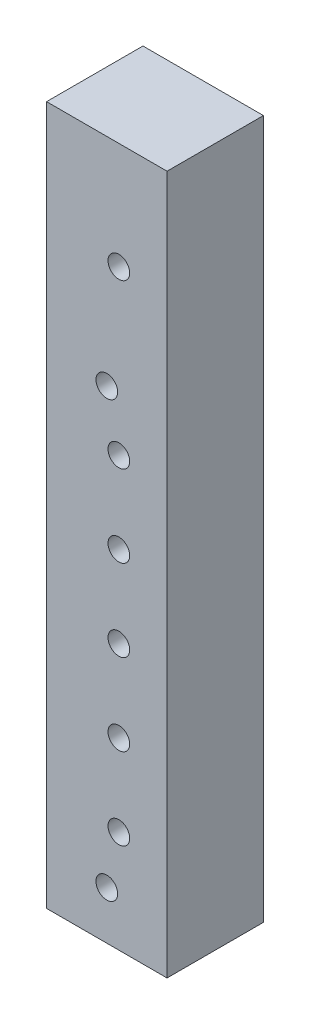
ISO-10303-21;
HEADER;
FILE_DESCRIPTION(('STEP AP214'),'2;1');
FILE_NAME('part.step','',(''),(''),'','','');
FILE_SCHEMA(('AUTOMOTIVE_DESIGN { 1 0 10303 214 1 1 1 1 }'));
ENDSEC;
DATA;
#1=APPLICATION_CONTEXT('core data for automotive mechanical design processes');
#2=APPLICATION_PROTOCOL_DEFINITION('international standard','automotive_design',2000,#1);
#3=PRODUCT_CONTEXT('',#1,'mechanical');
#4=PRODUCT('Part','Part','',(#3));
#5=PRODUCT_RELATED_PRODUCT_CATEGORY('part','',(#4));
#6=PRODUCT_DEFINITION_FORMATION('','',#4);
#7=PRODUCT_DEFINITION_CONTEXT('part definition',#1,'design');
#8=PRODUCT_DEFINITION('design','',#6,#7);
#9=PRODUCT_DEFINITION_SHAPE('','',#8);
#10=(LENGTH_UNIT() NAMED_UNIT(*) SI_UNIT(.MILLI.,.METRE.));
#11=(NAMED_UNIT(*) PLANE_ANGLE_UNIT() SI_UNIT($,.RADIAN.));
#12=(NAMED_UNIT(*) SI_UNIT($,.STERADIAN.) SOLID_ANGLE_UNIT());
#13=UNCERTAINTY_MEASURE_WITH_UNIT(LENGTH_MEASURE(1.E-05),#10,'distance_accuracy_value','');
#14=(GEOMETRIC_REPRESENTATION_CONTEXT(3) GLOBAL_UNCERTAINTY_ASSIGNED_CONTEXT((#13)) GLOBAL_UNIT_ASSIGNED_CONTEXT((#10,
#11,#12)) REPRESENTATION_CONTEXT('',''));
#15=CARTESIAN_POINT('',(0.,0.,0.));
#16=DIRECTION('',(0.,0.,1.));
#17=DIRECTION('',(1.,0.,0.));
#18=AXIS2_PLACEMENT_3D('',#15,#16,#17);
#19=CARTESIAN_POINT('',(7.5,87.,6.));
#20=DIRECTION('',(1.,0.,0.));
#21=DIRECTION('',(0.,0.,-1.));
#22=AXIS2_PLACEMENT_3D('',#19,#20,#21);
#23=PLANE('',#22);
#24=DIRECTION('',(0.,-1.,0.));
#25=VECTOR('',#24,1.);
#26=CARTESIAN_POINT('',(7.5,87.,-6.));
#27=LINE('',#26,#25);
#28=CARTESIAN_POINT('',(7.5,87.,-6.));
#29=VERTEX_POINT('',#28);
#30=CARTESIAN_POINT('',(7.5,0.,-6.));
#31=VERTEX_POINT('',#30);
#32=EDGE_CURVE('E102',#29,#31,#27,.T.);
#33=ORIENTED_EDGE('',*,*,#32,.F.);
#34=DIRECTION('',(0.,0.,-1.));
#35=VECTOR('',#34,1.);
#36=CARTESIAN_POINT('',(7.5,87.,6.));
#37=LINE('',#36,#35);
#38=CARTESIAN_POINT('',(7.5,87.,6.));
#39=VERTEX_POINT('',#38);
#40=EDGE_CURVE('E11',#39,#29,#37,.T.);
#41=ORIENTED_EDGE('',*,*,#40,.F.);
#42=DIRECTION('',(0.,-1.,0.));
#43=VECTOR('',#42,1.);
#44=CARTESIAN_POINT('',(7.5,87.,6.));
#45=LINE('',#44,#43);
#46=CARTESIAN_POINT('',(7.5,0.,6.));
#47=VERTEX_POINT('',#46);
#48=EDGE_CURVE('E95',#39,#47,#45,.T.);
#49=ORIENTED_EDGE('',*,*,#48,.T.);
#50=DIRECTION('',(0.,0.,-1.));
#51=VECTOR('',#50,1.);
#52=CARTESIAN_POINT('',(7.5,0.,6.));
#53=LINE('',#52,#51);
#54=EDGE_CURVE('E40',#47,#31,#53,.T.);
#55=ORIENTED_EDGE('',*,*,#54,.T.);
#56=EDGE_LOOP('',(#33,#41,#49,#55));
#57=FACE_BOUND('',#56,.T.);
#58=ADVANCED_FACE('F37',(#57),#23,.T.);
#59=CARTESIAN_POINT('',(-7.5,87.,6.));
#60=DIRECTION('',(0.,1.,0.));
#61=DIRECTION('',(0.,0.,1.));
#62=AXIS2_PLACEMENT_3D('',#59,#60,#61);
#63=PLANE('',#62);
#64=DIRECTION('',(1.,0.,0.));
#65=VECTOR('',#64,1.);
#66=CARTESIAN_POINT('',(-7.5,87.,-6.));
#67=LINE('',#66,#65);
#68=CARTESIAN_POINT('',(-7.5,87.,-6.));
#69=VERTEX_POINT('',#68);
#70=EDGE_CURVE('E97',#69,#29,#67,.T.);
#71=ORIENTED_EDGE('',*,*,#70,.F.);
#72=DIRECTION('',(0.,0.,-1.));
#73=VECTOR('',#72,1.);
#74=CARTESIAN_POINT('',(-7.5,87.,6.));
#75=LINE('',#74,#73);
#76=CARTESIAN_POINT('',(-7.5,87.,6.));
#77=VERTEX_POINT('',#76);
#78=EDGE_CURVE('E46',#77,#69,#75,.T.);
#79=ORIENTED_EDGE('',*,*,#78,.F.);
#80=DIRECTION('',(1.,0.,0.));
#81=VECTOR('',#80,1.);
#82=CARTESIAN_POINT('',(-7.5,87.,6.));
#83=LINE('',#82,#81);
#84=EDGE_CURVE('E92',#77,#39,#83,.T.);
#85=ORIENTED_EDGE('',*,*,#84,.T.);
#86=ORIENTED_EDGE('',*,*,#40,.T.);
#87=EDGE_LOOP('',(#71,#79,#85,#86));
#88=FACE_BOUND('',#87,.T.);
#89=ADVANCED_FACE('F113',(#88),#63,.T.);
#90=CARTESIAN_POINT('',(-7.5,0.,6.));
#91=DIRECTION('',(-1.,0.,0.));
#92=DIRECTION('',(0.,0.,1.));
#93=AXIS2_PLACEMENT_3D('',#90,#91,#92);
#94=PLANE('',#93);
#95=DIRECTION('',(0.,1.,0.));
#96=VECTOR('',#95,1.);
#97=CARTESIAN_POINT('',(-7.5,0.,-6.));
#98=LINE('',#97,#96);
#99=CARTESIAN_POINT('',(-7.5,0.,-6.));
#100=VERTEX_POINT('',#99);
#101=EDGE_CURVE('E87',#100,#69,#98,.T.);
#102=ORIENTED_EDGE('',*,*,#101,.F.);
#103=DIRECTION('',(0.,0.,-1.));
#104=VECTOR('',#103,1.);
#105=CARTESIAN_POINT('',(-7.5,0.,6.));
#106=LINE('',#105,#104);
#107=CARTESIAN_POINT('',(-7.5,0.,6.));
#108=VERTEX_POINT('',#107);
#109=EDGE_CURVE('E82',#108,#100,#106,.T.);
#110=ORIENTED_EDGE('',*,*,#109,.F.);
#111=DIRECTION('',(0.,1.,0.));
#112=VECTOR('',#111,1.);
#113=CARTESIAN_POINT('',(-7.5,0.,6.));
#114=LINE('',#113,#112);
#115=EDGE_CURVE('E85',#108,#77,#114,.T.);
#116=ORIENTED_EDGE('',*,*,#115,.T.);
#117=ORIENTED_EDGE('',*,*,#78,.T.);
#118=EDGE_LOOP('',(#102,#110,#116,#117));
#119=FACE_BOUND('',#118,.T.);
#120=ADVANCED_FACE('F84',(#119),#94,.T.);
#121=CARTESIAN_POINT('',(7.5,0.,6.));
#122=DIRECTION('',(0.,-1.,0.));
#123=DIRECTION('',(0.,0.,-1.));
#124=AXIS2_PLACEMENT_3D('',#121,#122,#123);
#125=PLANE('',#124);
#126=DIRECTION('',(-1.,0.,0.));
#127=VECTOR('',#126,1.);
#128=CARTESIAN_POINT('',(7.5,0.,-6.));
#129=LINE('',#128,#127);
#130=EDGE_CURVE('E105',#31,#100,#129,.T.);
#131=ORIENTED_EDGE('',*,*,#130,.F.);
#132=ORIENTED_EDGE('',*,*,#54,.F.);
#133=DIRECTION('',(-1.,0.,0.));
#134=VECTOR('',#133,1.);
#135=CARTESIAN_POINT('',(7.5,0.,6.));
#136=LINE('',#135,#134);
#137=EDGE_CURVE('E91',#47,#108,#136,.T.);
#138=ORIENTED_EDGE('',*,*,#137,.T.);
#139=ORIENTED_EDGE('',*,*,#109,.T.);
#140=EDGE_LOOP('',(#131,#132,#138,#139));
#141=FACE_BOUND('',#140,.T.);
#142=ADVANCED_FACE('F94',(#141),#125,.T.);
#143=CARTESIAN_POINT('',(0.,0.,6.));
#144=DIRECTION('',(0.,0.,-1.));
#145=DIRECTION('',(-1.,0.,0.));
#146=AXIS2_PLACEMENT_3D('',#143,#144,#145);
#147=PLANE('',#146);
#148=CARTESIAN_POINT('',(1.5000000000002,73.69,6.));
#149=DIRECTION('',(0.,0.,-1.));
#150=DIRECTION('',(1.,0.,0.));
#151=AXIS2_PLACEMENT_3D('',#148,#149,#150);
#152=CIRCLE('',#151,1.35);
#153=CARTESIAN_POINT('',(2.8500000000002,73.69,6.));
#154=VERTEX_POINT('',#153);
#155=EDGE_CURVE('E170',#154,#154,#152,.T.);
#156=ORIENTED_EDGE('',*,*,#155,.T.);
#157=EDGE_LOOP('',(#156));
#158=FACE_BOUND('',#157,.T.);
#159=CARTESIAN_POINT('',(1.50000000000014,53.37,6.));
#160=DIRECTION('',(0.,0.,-1.));
#161=DIRECTION('',(1.,0.,0.));
#162=AXIS2_PLACEMENT_3D('',#159,#160,#161);
#163=CIRCLE('',#162,1.35);
#164=CARTESIAN_POINT('',(2.85000000000014,53.37,6.));
#165=VERTEX_POINT('',#164);
#166=EDGE_CURVE('E178',#165,#165,#163,.T.);
#167=ORIENTED_EDGE('',*,*,#166,.T.);
#168=EDGE_LOOP('',(#167));
#169=FACE_BOUND('',#168,.T.);
#170=CARTESIAN_POINT('',(1.50000000000007,33.05,6.));
#171=DIRECTION('',(0.,0.,-1.));
#172=DIRECTION('',(1.,0.,0.));
#173=AXIS2_PLACEMENT_3D('',#170,#171,#172);
#174=CIRCLE('',#173,1.35);
#175=CARTESIAN_POINT('',(2.85000000000007,33.05,6.));
#176=VERTEX_POINT('',#175);
#177=EDGE_CURVE('E184',#176,#176,#174,.T.);
#178=ORIENTED_EDGE('',*,*,#177,.T.);
#179=EDGE_LOOP('',(#178));
#180=FACE_BOUND('',#179,.T.);
#181=CARTESIAN_POINT('',(1.5,12.73,6.));
#182=DIRECTION('',(0.,0.,-1.));
#183=DIRECTION('',(1.,0.,0.));
#184=AXIS2_PLACEMENT_3D('',#181,#182,#183);
#185=CIRCLE('',#184,1.35);
#186=CARTESIAN_POINT('',(2.85,12.73,6.));
#187=VERTEX_POINT('',#186);
#188=EDGE_CURVE('E190',#187,#187,#185,.T.);
#189=ORIENTED_EDGE('',*,*,#188,.T.);
#190=EDGE_LOOP('',(#189));
#191=FACE_BOUND('',#190,.T.);
#192=CARTESIAN_POINT('',(0.,6.,6.));
#193=DIRECTION('',(0.,0.,-1.));
#194=DIRECTION('',(1.,0.,0.));
#195=AXIS2_PLACEMENT_3D('',#192,#193,#194);
#196=CIRCLE('',#195,1.35);
#197=CARTESIAN_POINT('',(1.35,6.,6.));
#198=VERTEX_POINT('',#197);
#199=EDGE_CURVE('E196',#198,#198,#196,.T.);
#200=ORIENTED_EDGE('',*,*,#199,.T.);
#201=EDGE_LOOP('',(#200));
#202=FACE_BOUND('',#201,.T.);
#203=CARTESIAN_POINT('',(0.,60.1,6.));
#204=DIRECTION('',(0.,0.,-1.));
#205=DIRECTION('',(1.,0.,0.));
#206=AXIS2_PLACEMENT_3D('',#203,#204,#205);
#207=CIRCLE('',#206,1.35);
#208=CARTESIAN_POINT('',(1.35,60.1,6.));
#209=VERTEX_POINT('',#208);
#210=EDGE_CURVE('E202',#209,#209,#207,.T.);
#211=ORIENTED_EDGE('',*,*,#210,.T.);
#212=EDGE_LOOP('',(#211));
#213=FACE_BOUND('',#212,.T.);
#214=CARTESIAN_POINT('',(1.5000000000001,43.21,6.));
#215=DIRECTION('',(0.,0.,-1.));
#216=DIRECTION('',(1.,0.,0.));
#217=AXIS2_PLACEMENT_3D('',#214,#215,#216);
#218=CIRCLE('',#217,1.34999999999999);
#219=CARTESIAN_POINT('',(2.85000000000009,43.21,6.));
#220=VERTEX_POINT('',#219);
#221=EDGE_CURVE('E208',#220,#220,#218,.T.);
#222=ORIENTED_EDGE('',*,*,#221,.T.);
#223=EDGE_LOOP('',(#222));
#224=FACE_BOUND('',#223,.T.);
#225=CARTESIAN_POINT('',(1.50000000000003,22.89,6.));
#226=DIRECTION('',(0.,0.,-1.));
#227=DIRECTION('',(1.,0.,0.));
#228=AXIS2_PLACEMENT_3D('',#225,#226,#227);
#229=CIRCLE('',#228,1.34999999999999);
#230=CARTESIAN_POINT('',(2.85000000000002,22.89,6.));
#231=VERTEX_POINT('',#230);
#232=EDGE_CURVE('E106',#231,#231,#229,.T.);
#233=ORIENTED_EDGE('',*,*,#232,.T.);
#234=EDGE_LOOP('',(#233));
#235=FACE_BOUND('',#234,.T.);
#236=ORIENTED_EDGE('',*,*,#48,.F.);
#237=ORIENTED_EDGE('',*,*,#84,.F.);
#238=ORIENTED_EDGE('',*,*,#115,.F.);
#239=ORIENTED_EDGE('',*,*,#137,.F.);
#240=EDGE_LOOP('',(#236,#237,#238,#239));
#241=FACE_BOUND('',#240,.T.);
#242=ADVANCED_FACE('F90',(#158,#169,#180,#191,#202,#213,#224,#235,#241),#147,.F.);
#243=CARTESIAN_POINT('',(0.,0.,-6.));
#244=DIRECTION('',(0.,0.,-1.));
#245=DIRECTION('',(-1.,0.,0.));
#246=AXIS2_PLACEMENT_3D('',#243,#244,#245);
#247=PLANE('',#246);
#248=CARTESIAN_POINT('',(1.5000000000002,73.69,-6.));
#249=DIRECTION('',(0.,0.,-1.));
#250=DIRECTION('',(1.,0.,0.));
#251=AXIS2_PLACEMENT_3D('',#248,#249,#250);
#252=CIRCLE('',#251,1.35);
#253=CARTESIAN_POINT('',(2.8500000000002,73.69,-6.));
#254=VERTEX_POINT('',#253);
#255=EDGE_CURVE('E173',#254,#254,#252,.T.);
#256=ORIENTED_EDGE('',*,*,#255,.F.);
#257=EDGE_LOOP('',(#256));
#258=FACE_BOUND('',#257,.T.);
#259=CARTESIAN_POINT('',(1.50000000000014,53.37,-6.));
#260=DIRECTION('',(0.,0.,-1.));
#261=DIRECTION('',(1.,0.,0.));
#262=AXIS2_PLACEMENT_3D('',#259,#260,#261);
#263=CIRCLE('',#262,1.35);
#264=CARTESIAN_POINT('',(2.85000000000014,53.37,-6.));
#265=VERTEX_POINT('',#264);
#266=EDGE_CURVE('E175',#265,#265,#263,.T.);
#267=ORIENTED_EDGE('',*,*,#266,.F.);
#268=EDGE_LOOP('',(#267));
#269=FACE_BOUND('',#268,.T.);
#270=CARTESIAN_POINT('',(1.50000000000007,33.05,-6.));
#271=DIRECTION('',(0.,0.,-1.));
#272=DIRECTION('',(1.,0.,0.));
#273=AXIS2_PLACEMENT_3D('',#270,#271,#272);
#274=CIRCLE('',#273,1.35);
#275=CARTESIAN_POINT('',(2.85000000000007,33.05,-6.));
#276=VERTEX_POINT('',#275);
#277=EDGE_CURVE('E181',#276,#276,#274,.T.);
#278=ORIENTED_EDGE('',*,*,#277,.F.);
#279=EDGE_LOOP('',(#278));
#280=FACE_BOUND('',#279,.T.);
#281=CARTESIAN_POINT('',(1.5,12.73,-6.));
#282=DIRECTION('',(0.,0.,-1.));
#283=DIRECTION('',(1.,0.,0.));
#284=AXIS2_PLACEMENT_3D('',#281,#282,#283);
#285=CIRCLE('',#284,1.35);
#286=CARTESIAN_POINT('',(2.85,12.73,-6.));
#287=VERTEX_POINT('',#286);
#288=EDGE_CURVE('E187',#287,#287,#285,.T.);
#289=ORIENTED_EDGE('',*,*,#288,.F.);
#290=EDGE_LOOP('',(#289));
#291=FACE_BOUND('',#290,.T.);
#292=CARTESIAN_POINT('',(0.,6.,-6.));
#293=DIRECTION('',(0.,0.,-1.));
#294=DIRECTION('',(1.,0.,0.));
#295=AXIS2_PLACEMENT_3D('',#292,#293,#294);
#296=CIRCLE('',#295,1.35);
#297=CARTESIAN_POINT('',(1.35,6.,-6.));
#298=VERTEX_POINT('',#297);
#299=EDGE_CURVE('E193',#298,#298,#296,.T.);
#300=ORIENTED_EDGE('',*,*,#299,.F.);
#301=EDGE_LOOP('',(#300));
#302=FACE_BOUND('',#301,.T.);
#303=CARTESIAN_POINT('',(0.,60.1,-6.));
#304=DIRECTION('',(0.,0.,-1.));
#305=DIRECTION('',(1.,0.,0.));
#306=AXIS2_PLACEMENT_3D('',#303,#304,#305);
#307=CIRCLE('',#306,1.35);
#308=CARTESIAN_POINT('',(1.35,60.1,-6.));
#309=VERTEX_POINT('',#308);
#310=EDGE_CURVE('E199',#309,#309,#307,.T.);
#311=ORIENTED_EDGE('',*,*,#310,.F.);
#312=EDGE_LOOP('',(#311));
#313=FACE_BOUND('',#312,.T.);
#314=CARTESIAN_POINT('',(1.5000000000001,43.21,-6.));
#315=DIRECTION('',(0.,0.,-1.));
#316=DIRECTION('',(1.,0.,0.));
#317=AXIS2_PLACEMENT_3D('',#314,#315,#316);
#318=CIRCLE('',#317,1.34999999999999);
#319=CARTESIAN_POINT('',(2.85000000000009,43.21,-6.));
#320=VERTEX_POINT('',#319);
#321=EDGE_CURVE('E205',#320,#320,#318,.T.);
#322=ORIENTED_EDGE('',*,*,#321,.F.);
#323=EDGE_LOOP('',(#322));
#324=FACE_BOUND('',#323,.T.);
#325=CARTESIAN_POINT('',(1.50000000000003,22.89,-6.));
#326=DIRECTION('',(0.,0.,-1.));
#327=DIRECTION('',(1.,0.,0.));
#328=AXIS2_PLACEMENT_3D('',#325,#326,#327);
#329=CIRCLE('',#328,1.34999999999999);
#330=CARTESIAN_POINT('',(2.85000000000002,22.89,-6.));
#331=VERTEX_POINT('',#330);
#332=EDGE_CURVE('E211',#331,#331,#329,.T.);
#333=ORIENTED_EDGE('',*,*,#332,.F.);
#334=EDGE_LOOP('',(#333));
#335=FACE_BOUND('',#334,.T.);
#336=ORIENTED_EDGE('',*,*,#32,.T.);
#337=ORIENTED_EDGE('',*,*,#130,.T.);
#338=ORIENTED_EDGE('',*,*,#101,.T.);
#339=ORIENTED_EDGE('',*,*,#70,.T.);
#340=EDGE_LOOP('',(#336,#337,#338,#339));
#341=FACE_BOUND('',#340,.T.);
#342=ADVANCED_FACE('F112',(#258,#269,#280,#291,#302,#313,#324,#335,#341),#247,.T.);
#343=CARTESIAN_POINT('',(1.50000000000003,22.89,6.));
#344=DIRECTION('',(0.,0.,-1.));
#345=DIRECTION('',(-1.,0.,0.));
#346=AXIS2_PLACEMENT_3D('',#343,#344,#345);
#347=CYLINDRICAL_SURFACE('',#346,1.34999999999999);
#348=ORIENTED_EDGE('',*,*,#232,.F.);
#349=EDGE_LOOP('',(#348));
#350=FACE_BOUND('',#349,.T.);
#351=ORIENTED_EDGE('',*,*,#332,.T.);
#352=EDGE_LOOP('',(#351));
#353=FACE_BOUND('',#352,.T.);
#354=ADVANCED_FACE('F131',(#350,#353),#347,.F.);
#355=CARTESIAN_POINT('',(1.5000000000001,43.21,6.));
#356=DIRECTION('',(0.,0.,-1.));
#357=DIRECTION('',(-1.,0.,0.));
#358=AXIS2_PLACEMENT_3D('',#355,#356,#357);
#359=CYLINDRICAL_SURFACE('',#358,1.34999999999999);
#360=ORIENTED_EDGE('',*,*,#221,.F.);
#361=EDGE_LOOP('',(#360));
#362=FACE_BOUND('',#361,.T.);
#363=ORIENTED_EDGE('',*,*,#321,.T.);
#364=EDGE_LOOP('',(#363));
#365=FACE_BOUND('',#364,.T.);
#366=ADVANCED_FACE('F138',(#362,#365),#359,.F.);
#367=CARTESIAN_POINT('',(0.,60.1,6.));
#368=DIRECTION('',(0.,0.,-1.));
#369=DIRECTION('',(-1.,0.,0.));
#370=AXIS2_PLACEMENT_3D('',#367,#368,#369);
#371=CYLINDRICAL_SURFACE('',#370,1.35);
#372=ORIENTED_EDGE('',*,*,#210,.F.);
#373=EDGE_LOOP('',(#372));
#374=FACE_BOUND('',#373,.T.);
#375=ORIENTED_EDGE('',*,*,#310,.T.);
#376=EDGE_LOOP('',(#375));
#377=FACE_BOUND('',#376,.T.);
#378=ADVANCED_FACE('F142',(#374,#377),#371,.F.);
#379=CARTESIAN_POINT('',(0.,6.,6.));
#380=DIRECTION('',(0.,0.,-1.));
#381=DIRECTION('',(-1.,0.,0.));
#382=AXIS2_PLACEMENT_3D('',#379,#380,#381);
#383=CYLINDRICAL_SURFACE('',#382,1.35);
#384=ORIENTED_EDGE('',*,*,#199,.F.);
#385=EDGE_LOOP('',(#384));
#386=FACE_BOUND('',#385,.T.);
#387=ORIENTED_EDGE('',*,*,#299,.T.);
#388=EDGE_LOOP('',(#387));
#389=FACE_BOUND('',#388,.T.);
#390=ADVANCED_FACE('F146',(#386,#389),#383,.F.);
#391=CARTESIAN_POINT('',(1.5,12.73,6.));
#392=DIRECTION('',(0.,0.,-1.));
#393=DIRECTION('',(-1.,0.,0.));
#394=AXIS2_PLACEMENT_3D('',#391,#392,#393);
#395=CYLINDRICAL_SURFACE('',#394,1.35);
#396=ORIENTED_EDGE('',*,*,#188,.F.);
#397=EDGE_LOOP('',(#396));
#398=FACE_BOUND('',#397,.T.);
#399=ORIENTED_EDGE('',*,*,#288,.T.);
#400=EDGE_LOOP('',(#399));
#401=FACE_BOUND('',#400,.T.);
#402=ADVANCED_FACE('F150',(#398,#401),#395,.F.);
#403=CARTESIAN_POINT('',(1.50000000000007,33.05,6.));
#404=DIRECTION('',(0.,0.,-1.));
#405=DIRECTION('',(-1.,0.,0.));
#406=AXIS2_PLACEMENT_3D('',#403,#404,#405);
#407=CYLINDRICAL_SURFACE('',#406,1.35);
#408=ORIENTED_EDGE('',*,*,#177,.F.);
#409=EDGE_LOOP('',(#408));
#410=FACE_BOUND('',#409,.T.);
#411=ORIENTED_EDGE('',*,*,#277,.T.);
#412=EDGE_LOOP('',(#411));
#413=FACE_BOUND('',#412,.T.);
#414=ADVANCED_FACE('F154',(#410,#413),#407,.F.);
#415=CARTESIAN_POINT('',(1.50000000000014,53.37,6.));
#416=DIRECTION('',(0.,0.,-1.));
#417=DIRECTION('',(-1.,0.,0.));
#418=AXIS2_PLACEMENT_3D('',#415,#416,#417);
#419=CYLINDRICAL_SURFACE('',#418,1.35);
#420=ORIENTED_EDGE('',*,*,#166,.F.);
#421=EDGE_LOOP('',(#420));
#422=FACE_BOUND('',#421,.T.);
#423=ORIENTED_EDGE('',*,*,#266,.T.);
#424=EDGE_LOOP('',(#423));
#425=FACE_BOUND('',#424,.T.);
#426=ADVANCED_FACE('F158',(#422,#425),#419,.F.);
#427=CARTESIAN_POINT('',(1.5000000000002,73.69,6.));
#428=DIRECTION('',(0.,0.,-1.));
#429=DIRECTION('',(-1.,0.,0.));
#430=AXIS2_PLACEMENT_3D('',#427,#428,#429);
#431=CYLINDRICAL_SURFACE('',#430,1.35);
#432=ORIENTED_EDGE('',*,*,#155,.F.);
#433=EDGE_LOOP('',(#432));
#434=FACE_BOUND('',#433,.T.);
#435=ORIENTED_EDGE('',*,*,#255,.T.);
#436=EDGE_LOOP('',(#435));
#437=FACE_BOUND('',#436,.T.);
#438=ADVANCED_FACE('F162',(#434,#437),#431,.F.);
#439=CLOSED_SHELL('',(#58,#89,#120,#142,#242,#342,#354,#366,#378,#390,#402,#414,#426,#438));
#440=MANIFOLD_SOLID_BREP('B2',#439);
#441=ADVANCED_BREP_SHAPE_REPRESENTATION('',(#18,#440),#14);
#442=SHAPE_DEFINITION_REPRESENTATION(#9,#441);
ENDSEC;
END-ISO-10303-21;
